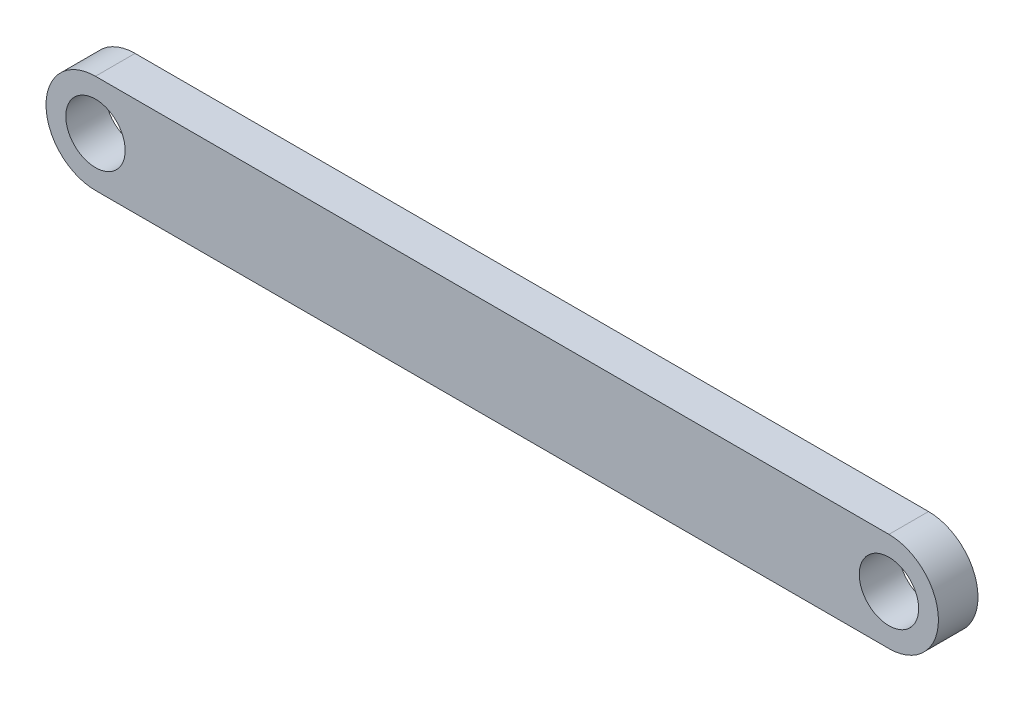
ISO-10303-21;
HEADER;
FILE_DESCRIPTION(('STEP AP214'),'2;1');
FILE_NAME('part.step','',(''),(''),'','','');
FILE_SCHEMA(('AUTOMOTIVE_DESIGN { 1 0 10303 214 1 1 1 1 }'));
ENDSEC;
DATA;
#1=APPLICATION_CONTEXT('core data for automotive mechanical design processes');
#2=APPLICATION_PROTOCOL_DEFINITION('international standard','automotive_design',2000,#1);
#3=PRODUCT_CONTEXT('',#1,'mechanical');
#4=PRODUCT('Part','Part','',(#3));
#5=PRODUCT_RELATED_PRODUCT_CATEGORY('part','',(#4));
#6=PRODUCT_DEFINITION_FORMATION('','',#4);
#7=PRODUCT_DEFINITION_CONTEXT('part definition',#1,'design');
#8=PRODUCT_DEFINITION('design','',#6,#7);
#9=PRODUCT_DEFINITION_SHAPE('','',#8);
#10=(LENGTH_UNIT() NAMED_UNIT(*) SI_UNIT(.MILLI.,.METRE.));
#11=(NAMED_UNIT(*) PLANE_ANGLE_UNIT() SI_UNIT($,.RADIAN.));
#12=(NAMED_UNIT(*) SI_UNIT($,.STERADIAN.) SOLID_ANGLE_UNIT());
#13=UNCERTAINTY_MEASURE_WITH_UNIT(LENGTH_MEASURE(1.E-05),#10,'distance_accuracy_value','');
#14=(GEOMETRIC_REPRESENTATION_CONTEXT(3) GLOBAL_UNCERTAINTY_ASSIGNED_CONTEXT((#13)) GLOBAL_UNIT_ASSIGNED_CONTEXT((#10,
#11,#12)) REPRESENTATION_CONTEXT('',''));
#15=CARTESIAN_POINT('',(0.,0.,0.));
#16=DIRECTION('',(0.,0.,1.));
#17=DIRECTION('',(1.,0.,0.));
#18=AXIS2_PLACEMENT_3D('',#15,#16,#17);
#19=CARTESIAN_POINT('',(0.144561731767878,-0.0727373095658402,2.));
#20=DIRECTION('',(0.,0.,1.));
#21=DIRECTION('',(1.,0.,0.));
#22=AXIS2_PLACEMENT_3D('',#19,#20,#21);
#23=PLANE('',#22);
#24=CARTESIAN_POINT('',(0.144561731767878,-0.0727373095658402,2.));
#25=DIRECTION('',(0.,0.,1.));
#26=DIRECTION('',(1.,0.,0.));
#27=AXIS2_PLACEMENT_3D('',#24,#25,#26);
#28=CIRCLE('',#27,1.5);
#29=CARTESIAN_POINT('',(1.64456173176788,-0.0727373095658402,2.));
#30=VERTEX_POINT('',#29);
#31=EDGE_CURVE('E99',#30,#30,#28,.T.);
#32=ORIENTED_EDGE('',*,*,#31,.F.);
#33=EDGE_LOOP('',(#32));
#34=FACE_BOUND('',#33,.T.);
#35=CARTESIAN_POINT('',(0.144561731767878,-0.0727373095658402,2.));
#36=DIRECTION('',(0.,0.,1.));
#37=DIRECTION('',(1.,0.,0.));
#38=AXIS2_PLACEMENT_3D('',#35,#36,#37);
#39=CIRCLE('',#38,2.5);
#40=CARTESIAN_POINT('',(0.144561731767878,2.42726269043416,2.));
#41=VERTEX_POINT('',#40);
#42=CARTESIAN_POINT('',(0.144561731767878,-2.57273730956584,2.));
#43=VERTEX_POINT('',#42);
#44=EDGE_CURVE('E84',#41,#43,#39,.T.);
#45=ORIENTED_EDGE('',*,*,#44,.T.);
#46=DIRECTION('',(1.,0.,0.));
#47=VECTOR('',#46,1.);
#48=CARTESIAN_POINT('',(0.144561731767878,-2.57273730956584,2.));
#49=LINE('',#48,#47);
#50=CARTESIAN_POINT('',(40.2445617317679,-2.57273730956584,2.));
#51=VERTEX_POINT('',#50);
#52=EDGE_CURVE('E79',#43,#51,#49,.T.);
#53=ORIENTED_EDGE('',*,*,#52,.T.);
#54=CARTESIAN_POINT('',(40.2445617317679,-0.0727373095658402,2.));
#55=DIRECTION('',(0.,0.,1.));
#56=DIRECTION('',(1.,0.,0.));
#57=AXIS2_PLACEMENT_3D('',#54,#55,#56);
#58=CIRCLE('',#57,2.5);
#59=CARTESIAN_POINT('',(40.2445617317679,2.42726269043416,2.));
#60=VERTEX_POINT('',#59);
#61=EDGE_CURVE('E82',#51,#60,#58,.T.);
#62=ORIENTED_EDGE('',*,*,#61,.T.);
#63=DIRECTION('',(-1.,0.,0.));
#64=VECTOR('',#63,1.);
#65=CARTESIAN_POINT('',(0.144561731767878,2.42726269043416,2.));
#66=LINE('',#65,#64);
#67=EDGE_CURVE('E49',#60,#41,#66,.T.);
#68=ORIENTED_EDGE('',*,*,#67,.T.);
#69=EDGE_LOOP('',(#45,#53,#62,#68));
#70=FACE_BOUND('',#69,.T.);
#71=CARTESIAN_POINT('',(40.2445617317679,-0.0727373095658402,2.));
#72=DIRECTION('',(0.,0.,1.));
#73=DIRECTION('',(1.,0.,0.));
#74=AXIS2_PLACEMENT_3D('',#71,#72,#73);
#75=CIRCLE('',#74,1.5);
#76=CARTESIAN_POINT('',(41.7445617317679,-0.0727373095658402,2.));
#77=VERTEX_POINT('',#76);
#78=EDGE_CURVE('E114',#77,#77,#75,.T.);
#79=ORIENTED_EDGE('',*,*,#78,.F.);
#80=EDGE_LOOP('',(#79));
#81=FACE_BOUND('',#80,.T.);
#82=ADVANCED_FACE('F32',(#34,#70,#81),#23,.T.);
#83=CARTESIAN_POINT('',(0.144561731767878,-0.0727373095658402,0.));
#84=DIRECTION('',(0.,0.,1.));
#85=DIRECTION('',(1.,0.,0.));
#86=AXIS2_PLACEMENT_3D('',#83,#84,#85);
#87=PLANE('',#86);
#88=CARTESIAN_POINT('',(0.144561731767878,-0.0727373095658402,0.));
#89=DIRECTION('',(0.,0.,1.));
#90=DIRECTION('',(1.,0.,0.));
#91=AXIS2_PLACEMENT_3D('',#88,#89,#90);
#92=CIRCLE('',#91,2.5);
#93=CARTESIAN_POINT('',(0.144561731767878,2.42726269043416,0.));
#94=VERTEX_POINT('',#93);
#95=CARTESIAN_POINT('',(0.144561731767878,-2.57273730956584,0.));
#96=VERTEX_POINT('',#95);
#97=EDGE_CURVE('E96',#94,#96,#92,.T.);
#98=ORIENTED_EDGE('',*,*,#97,.F.);
#99=DIRECTION('',(-1.,0.,0.));
#100=VECTOR('',#99,1.);
#101=CARTESIAN_POINT('',(0.144561731767878,2.42726269043416,0.));
#102=LINE('',#101,#100);
#103=CARTESIAN_POINT('',(40.2445617317679,2.42726269043416,0.));
#104=VERTEX_POINT('',#103);
#105=EDGE_CURVE('E72',#104,#94,#102,.T.);
#106=ORIENTED_EDGE('',*,*,#105,.F.);
#107=CARTESIAN_POINT('',(40.2445617317679,-0.0727373095658402,0.));
#108=DIRECTION('',(0.,0.,1.));
#109=DIRECTION('',(1.,0.,0.));
#110=AXIS2_PLACEMENT_3D('',#107,#108,#109);
#111=CIRCLE('',#110,2.5);
#112=CARTESIAN_POINT('',(40.2445617317679,-2.57273730956584,0.));
#113=VERTEX_POINT('',#112);
#114=EDGE_CURVE('E66',#113,#104,#111,.T.);
#115=ORIENTED_EDGE('',*,*,#114,.F.);
#116=DIRECTION('',(1.,0.,0.));
#117=VECTOR('',#116,1.);
#118=CARTESIAN_POINT('',(0.144561731767878,-2.57273730956584,0.));
#119=LINE('',#118,#117);
#120=EDGE_CURVE('E88',#96,#113,#119,.T.);
#121=ORIENTED_EDGE('',*,*,#120,.F.);
#122=EDGE_LOOP('',(#98,#106,#115,#121));
#123=FACE_BOUND('',#122,.T.);
#124=CARTESIAN_POINT('',(0.144561731767878,-0.0727373095658402,0.));
#125=DIRECTION('',(0.,0.,1.));
#126=DIRECTION('',(1.,0.,0.));
#127=AXIS2_PLACEMENT_3D('',#124,#125,#126);
#128=CIRCLE('',#127,1.5);
#129=CARTESIAN_POINT('',(1.64456173176788,-0.0727373095658402,0.));
#130=VERTEX_POINT('',#129);
#131=EDGE_CURVE('E111',#130,#130,#128,.T.);
#132=ORIENTED_EDGE('',*,*,#131,.T.);
#133=EDGE_LOOP('',(#132));
#134=FACE_BOUND('',#133,.T.);
#135=CARTESIAN_POINT('',(40.2445617317679,-0.0727373095658402,0.));
#136=DIRECTION('',(0.,0.,1.));
#137=DIRECTION('',(1.,0.,0.));
#138=AXIS2_PLACEMENT_3D('',#135,#136,#137);
#139=CIRCLE('',#138,1.5);
#140=CARTESIAN_POINT('',(41.7445617317679,-0.0727373095658402,0.));
#141=VERTEX_POINT('',#140);
#142=EDGE_CURVE('E117',#141,#141,#139,.T.);
#143=ORIENTED_EDGE('',*,*,#142,.T.);
#144=EDGE_LOOP('',(#143));
#145=FACE_BOUND('',#144,.T.);
#146=ADVANCED_FACE('F107',(#123,#134,#145),#87,.F.);
#147=CARTESIAN_POINT('',(0.144561731767878,-0.0727373095658402,2.));
#148=DIRECTION('',(0.,0.,-1.));
#149=DIRECTION('',(-1.,0.,0.));
#150=AXIS2_PLACEMENT_3D('',#147,#148,#149);
#151=CYLINDRICAL_SURFACE('',#150,2.5);
#152=ORIENTED_EDGE('',*,*,#97,.T.);
#153=DIRECTION('',(0.,0.,-1.));
#154=VECTOR('',#153,1.);
#155=CARTESIAN_POINT('',(0.144561731767878,-2.57273730956584,2.));
#156=LINE('',#155,#154);
#157=EDGE_CURVE('E11',#43,#96,#156,.T.);
#158=ORIENTED_EDGE('',*,*,#157,.F.);
#159=ORIENTED_EDGE('',*,*,#44,.F.);
#160=DIRECTION('',(0.,0.,-1.));
#161=VECTOR('',#160,1.);
#162=CARTESIAN_POINT('',(0.144561731767878,2.42726269043416,2.));
#163=LINE('',#162,#161);
#164=EDGE_CURVE('E92',#41,#94,#163,.T.);
#165=ORIENTED_EDGE('',*,*,#164,.T.);
#166=EDGE_LOOP('',(#152,#158,#159,#165));
#167=FACE_BOUND('',#166,.T.);
#168=ADVANCED_FACE('F34',(#167),#151,.T.);
#169=CARTESIAN_POINT('',(0.144561731767878,-2.57273730956584,2.));
#170=DIRECTION('',(0.,1.,0.));
#171=DIRECTION('',(0.,0.,1.));
#172=AXIS2_PLACEMENT_3D('',#169,#170,#171);
#173=PLANE('',#172);
#174=ORIENTED_EDGE('',*,*,#120,.T.);
#175=DIRECTION('',(0.,0.,-1.));
#176=VECTOR('',#175,1.);
#177=CARTESIAN_POINT('',(40.2445617317679,-2.57273730956584,2.));
#178=LINE('',#177,#176);
#179=EDGE_CURVE('E41',#51,#113,#178,.T.);
#180=ORIENTED_EDGE('',*,*,#179,.F.);
#181=ORIENTED_EDGE('',*,*,#52,.F.);
#182=ORIENTED_EDGE('',*,*,#157,.T.);
#183=EDGE_LOOP('',(#174,#180,#181,#182));
#184=FACE_BOUND('',#183,.T.);
#185=ADVANCED_FACE('F87',(#184),#173,.F.);
#186=CARTESIAN_POINT('',(40.2445617317679,-0.0727373095658402,2.));
#187=DIRECTION('',(0.,0.,-1.));
#188=DIRECTION('',(-1.,0.,0.));
#189=AXIS2_PLACEMENT_3D('',#186,#187,#188);
#190=CYLINDRICAL_SURFACE('',#189,2.5);
#191=ORIENTED_EDGE('',*,*,#114,.T.);
#192=DIRECTION('',(0.,0.,-1.));
#193=VECTOR('',#192,1.);
#194=CARTESIAN_POINT('',(40.2445617317679,2.42726269043416,2.));
#195=LINE('',#194,#193);
#196=EDGE_CURVE('E89',#60,#104,#195,.T.);
#197=ORIENTED_EDGE('',*,*,#196,.F.);
#198=ORIENTED_EDGE('',*,*,#61,.F.);
#199=ORIENTED_EDGE('',*,*,#179,.T.);
#200=EDGE_LOOP('',(#191,#197,#198,#199));
#201=FACE_BOUND('',#200,.T.);
#202=ADVANCED_FACE('F90',(#201),#190,.T.);
#203=CARTESIAN_POINT('',(0.144561731767878,2.42726269043416,2.));
#204=DIRECTION('',(0.,-1.,0.));
#205=DIRECTION('',(0.,0.,-1.));
#206=AXIS2_PLACEMENT_3D('',#203,#204,#205);
#207=PLANE('',#206);
#208=ORIENTED_EDGE('',*,*,#105,.T.);
#209=ORIENTED_EDGE('',*,*,#164,.F.);
#210=ORIENTED_EDGE('',*,*,#67,.F.);
#211=ORIENTED_EDGE('',*,*,#196,.T.);
#212=EDGE_LOOP('',(#208,#209,#210,#211));
#213=FACE_BOUND('',#212,.T.);
#214=ADVANCED_FACE('F104',(#213),#207,.F.);
#215=CARTESIAN_POINT('',(0.144561731767878,-0.0727373095658402,2.));
#216=DIRECTION('',(0.,0.,-1.));
#217=DIRECTION('',(-1.,0.,0.));
#218=AXIS2_PLACEMENT_3D('',#215,#216,#217);
#219=CYLINDRICAL_SURFACE('',#218,1.5);
#220=ORIENTED_EDGE('',*,*,#31,.T.);
#221=EDGE_LOOP('',(#220));
#222=FACE_BOUND('',#221,.T.);
#223=ORIENTED_EDGE('',*,*,#131,.F.);
#224=EDGE_LOOP('',(#223));
#225=FACE_BOUND('',#224,.T.);
#226=ADVANCED_FACE('F134',(#222,#225),#219,.F.);
#227=CARTESIAN_POINT('',(40.2445617317679,-0.0727373095658402,2.));
#228=DIRECTION('',(0.,0.,-1.));
#229=DIRECTION('',(-1.,0.,0.));
#230=AXIS2_PLACEMENT_3D('',#227,#228,#229);
#231=CYLINDRICAL_SURFACE('',#230,1.5);
#232=ORIENTED_EDGE('',*,*,#78,.T.);
#233=EDGE_LOOP('',(#232));
#234=FACE_BOUND('',#233,.T.);
#235=ORIENTED_EDGE('',*,*,#142,.F.);
#236=EDGE_LOOP('',(#235));
#237=FACE_BOUND('',#236,.T.);
#238=ADVANCED_FACE('F123',(#234,#237),#231,.F.);
#239=CLOSED_SHELL('',(#82,#146,#168,#185,#202,#214,#226,#238));
#240=MANIFOLD_SOLID_BREP('B2',#239);
#241=ADVANCED_BREP_SHAPE_REPRESENTATION('',(#18,#240),#14);
#242=SHAPE_DEFINITION_REPRESENTATION(#9,#241);
ENDSEC;
END-ISO-10303-21;
